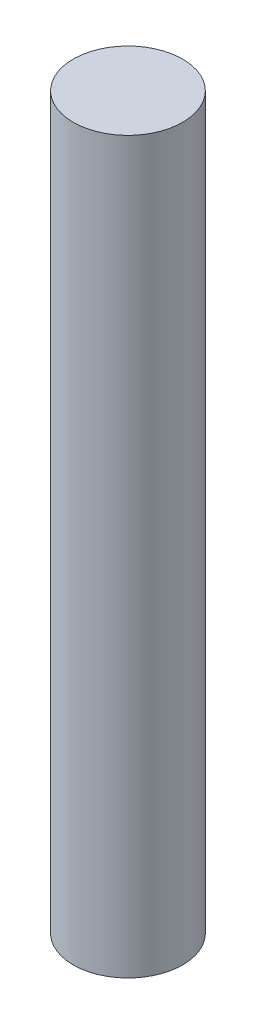
ISO-10303-21;
HEADER;
FILE_DESCRIPTION(('STEP AP214'),'2;1');
FILE_NAME('part.step','',(''),(''),'','','');
FILE_SCHEMA(('AUTOMOTIVE_DESIGN { 1 0 10303 214 1 1 1 1 }'));
ENDSEC;
DATA;
#1=APPLICATION_CONTEXT('core data for automotive mechanical design processes');
#2=APPLICATION_PROTOCOL_DEFINITION('international standard','automotive_design',2000,#1);
#3=PRODUCT_CONTEXT('',#1,'mechanical');
#4=PRODUCT('Part','Part','',(#3));
#5=PRODUCT_RELATED_PRODUCT_CATEGORY('part','',(#4));
#6=PRODUCT_DEFINITION_FORMATION('','',#4);
#7=PRODUCT_DEFINITION_CONTEXT('part definition',#1,'design');
#8=PRODUCT_DEFINITION('design','',#6,#7);
#9=PRODUCT_DEFINITION_SHAPE('','',#8);
#10=(LENGTH_UNIT() NAMED_UNIT(*) SI_UNIT(.MILLI.,.METRE.));
#11=(NAMED_UNIT(*) PLANE_ANGLE_UNIT() SI_UNIT($,.RADIAN.));
#12=(NAMED_UNIT(*) SI_UNIT($,.STERADIAN.) SOLID_ANGLE_UNIT());
#13=UNCERTAINTY_MEASURE_WITH_UNIT(LENGTH_MEASURE(1.E-05),#10,'distance_accuracy_value','');
#14=(GEOMETRIC_REPRESENTATION_CONTEXT(3) GLOBAL_UNCERTAINTY_ASSIGNED_CONTEXT((#13)) GLOBAL_UNIT_ASSIGNED_CONTEXT((#10,
#11,#12)) REPRESENTATION_CONTEXT('',''));
#15=CARTESIAN_POINT('',(0.,0.,0.));
#16=DIRECTION('',(0.,0.,1.));
#17=DIRECTION('',(1.,0.,0.));
#18=AXIS2_PLACEMENT_3D('',#15,#16,#17);
#19=CARTESIAN_POINT('',(0.,40.,0.));
#20=DIRECTION('',(0.,-1.,0.));
#21=DIRECTION('',(0.,0.,-1.));
#22=AXIS2_PLACEMENT_3D('',#19,#20,#21);
#23=CYLINDRICAL_SURFACE('',#22,3.);
#24=CARTESIAN_POINT('',(0.,40.,0.));
#25=DIRECTION('',(0.,1.,0.));
#26=DIRECTION('',(0.,0.,1.));
#27=AXIS2_PLACEMENT_3D('',#24,#25,#26);
#28=CIRCLE('',#27,3.);
#29=CARTESIAN_POINT('',(0.,40.,3.));
#30=VERTEX_POINT('',#29);
#31=EDGE_CURVE('E10',#30,#30,#28,.T.);
#32=ORIENTED_EDGE('',*,*,#31,.F.);
#33=EDGE_LOOP('',(#32));
#34=FACE_BOUND('',#33,.T.);
#35=CARTESIAN_POINT('',(0.,0.,0.));
#36=DIRECTION('',(0.,1.,0.));
#37=DIRECTION('',(0.,0.,1.));
#38=AXIS2_PLACEMENT_3D('',#35,#36,#37);
#39=CIRCLE('',#38,3.);
#40=CARTESIAN_POINT('',(0.,0.,3.));
#41=VERTEX_POINT('',#40);
#42=EDGE_CURVE('E34',#41,#41,#39,.T.);
#43=ORIENTED_EDGE('',*,*,#42,.T.);
#44=EDGE_LOOP('',(#43));
#45=FACE_BOUND('',#44,.T.);
#46=ADVANCED_FACE('F31',(#34,#45),#23,.T.);
#47=CARTESIAN_POINT('',(0.,40.,0.));
#48=DIRECTION('',(0.,1.,0.));
#49=DIRECTION('',(0.,0.,1.));
#50=AXIS2_PLACEMENT_3D('',#47,#48,#49);
#51=PLANE('',#50);
#52=ORIENTED_EDGE('',*,*,#31,.T.);
#53=EDGE_LOOP('',(#52));
#54=FACE_BOUND('',#53,.T.);
#55=ADVANCED_FACE('F46',(#54),#51,.T.);
#56=CARTESIAN_POINT('',(0.,0.,0.));
#57=DIRECTION('',(0.,1.,0.));
#58=DIRECTION('',(0.,0.,1.));
#59=AXIS2_PLACEMENT_3D('',#56,#57,#58);
#60=PLANE('',#59);
#61=ORIENTED_EDGE('',*,*,#42,.F.);
#62=EDGE_LOOP('',(#61));
#63=FACE_BOUND('',#62,.T.);
#64=ADVANCED_FACE('F44',(#63),#60,.F.);
#65=CLOSED_SHELL('',(#46,#55,#64));
#66=MANIFOLD_SOLID_BREP('B2',#65);
#67=ADVANCED_BREP_SHAPE_REPRESENTATION('',(#18,#66),#14);
#68=SHAPE_DEFINITION_REPRESENTATION(#9,#67);
ENDSEC;
END-ISO-10303-21;
